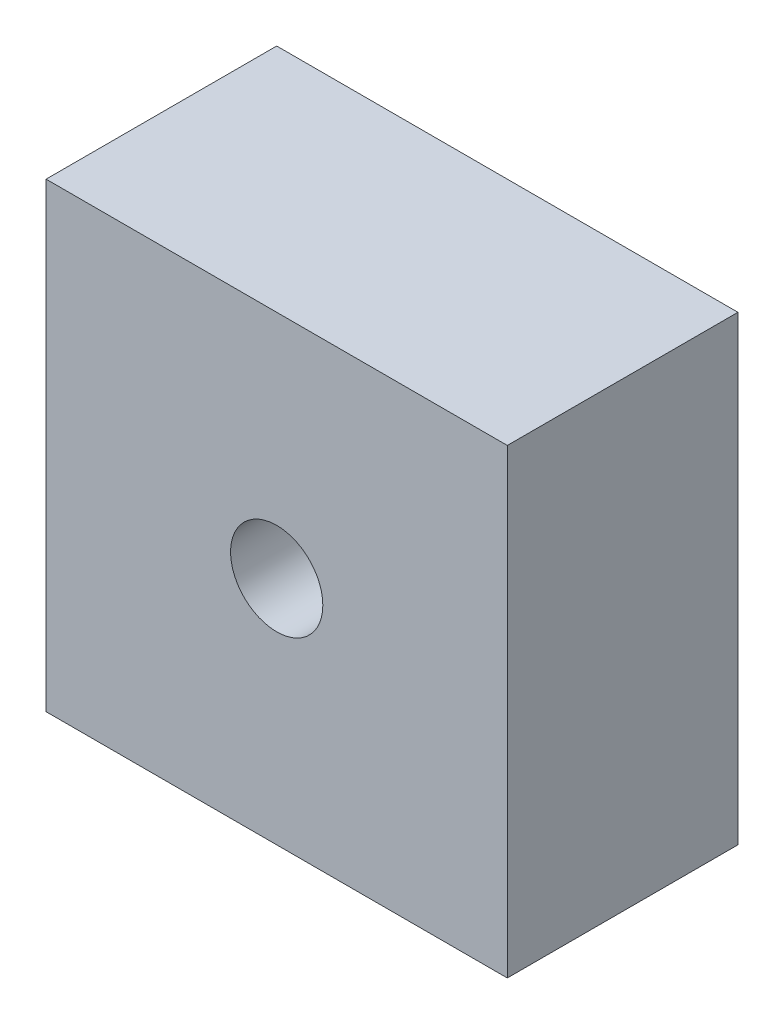
ISO-10303-21;
HEADER;
FILE_DESCRIPTION(('STEP AP214'),'2;1');
FILE_NAME('part.step','',(''),(''),'','','');
FILE_SCHEMA(('AUTOMOTIVE_DESIGN { 1 0 10303 214 1 1 1 1 }'));
ENDSEC;
DATA;
#1=APPLICATION_CONTEXT('core data for automotive mechanical design processes');
#2=APPLICATION_PROTOCOL_DEFINITION('international standard','automotive_design',2000,#1);
#3=PRODUCT_CONTEXT('',#1,'mechanical');
#4=PRODUCT('Part','Part','',(#3));
#5=PRODUCT_RELATED_PRODUCT_CATEGORY('part','',(#4));
#6=PRODUCT_DEFINITION_FORMATION('','',#4);
#7=PRODUCT_DEFINITION_CONTEXT('part definition',#1,'design');
#8=PRODUCT_DEFINITION('design','',#6,#7);
#9=PRODUCT_DEFINITION_SHAPE('','',#8);
#10=(LENGTH_UNIT() NAMED_UNIT(*) SI_UNIT(.MILLI.,.METRE.));
#11=(NAMED_UNIT(*) PLANE_ANGLE_UNIT() SI_UNIT($,.RADIAN.));
#12=(NAMED_UNIT(*) SI_UNIT($,.STERADIAN.) SOLID_ANGLE_UNIT());
#13=UNCERTAINTY_MEASURE_WITH_UNIT(LENGTH_MEASURE(1.E-05),#10,'distance_accuracy_value','');
#14=(GEOMETRIC_REPRESENTATION_CONTEXT(3) GLOBAL_UNCERTAINTY_ASSIGNED_CONTEXT((#13)) GLOBAL_UNIT_ASSIGNED_CONTEXT((#10,
#11,#12)) REPRESENTATION_CONTEXT('',''));
#15=CARTESIAN_POINT('',(0.,0.,0.));
#16=DIRECTION('',(0.,0.,1.));
#17=DIRECTION('',(1.,0.,0.));
#18=AXIS2_PLACEMENT_3D('',#15,#16,#17);
#19=CARTESIAN_POINT('',(-63.5,-63.5,-63.5));
#20=DIRECTION('',(-1.,0.,0.));
#21=DIRECTION('',(0.,0.,1.));
#22=AXIS2_PLACEMENT_3D('',#19,#20,#21);
#23=PLANE('',#22);
#24=DIRECTION('',(0.,-1.,0.));
#25=VECTOR('',#24,1.);
#26=CARTESIAN_POINT('',(-63.5,-63.5,0.));
#27=LINE('',#26,#25);
#28=CARTESIAN_POINT('',(-63.5,63.5,0.));
#29=VERTEX_POINT('',#28);
#30=CARTESIAN_POINT('',(-63.5,-63.5,0.));
#31=VERTEX_POINT('',#30);
#32=EDGE_CURVE('E105',#29,#31,#27,.T.);
#33=ORIENTED_EDGE('',*,*,#32,.F.);
#34=DIRECTION('',(0.,0.,1.));
#35=VECTOR('',#34,1.);
#36=CARTESIAN_POINT('',(-63.5,63.5,-63.5));
#37=LINE('',#36,#35);
#38=CARTESIAN_POINT('',(-63.5,63.5,-63.5));
#39=VERTEX_POINT('',#38);
#40=EDGE_CURVE('E11',#39,#29,#37,.T.);
#41=ORIENTED_EDGE('',*,*,#40,.F.);
#42=DIRECTION('',(0.,-1.,0.));
#43=VECTOR('',#42,1.);
#44=CARTESIAN_POINT('',(-63.5,-63.5,-63.5));
#45=LINE('',#44,#43);
#46=CARTESIAN_POINT('',(-63.5,-63.5,-63.5));
#47=VERTEX_POINT('',#46);
#48=EDGE_CURVE('E98',#39,#47,#45,.T.);
#49=ORIENTED_EDGE('',*,*,#48,.T.);
#50=DIRECTION('',(0.,0.,1.));
#51=VECTOR('',#50,1.);
#52=CARTESIAN_POINT('',(-63.5,-63.5,-63.5));
#53=LINE('',#52,#51);
#54=EDGE_CURVE('E42',#47,#31,#53,.T.);
#55=ORIENTED_EDGE('',*,*,#54,.T.);
#56=EDGE_LOOP('',(#33,#41,#49,#55));
#57=FACE_BOUND('',#56,.T.);
#58=ADVANCED_FACE('F39',(#57),#23,.T.);
#59=CARTESIAN_POINT('',(63.5,63.5,-63.5));
#60=DIRECTION('',(0.,1.,0.));
#61=DIRECTION('',(-1.,0.,0.));
#62=AXIS2_PLACEMENT_3D('',#59,#60,#61);
#63=PLANE('',#62);
#64=DIRECTION('',(-1.,0.,0.));
#65=VECTOR('',#64,1.);
#66=CARTESIAN_POINT('',(63.5,63.5,0.));
#67=LINE('',#66,#65);
#68=CARTESIAN_POINT('',(63.5,63.5,0.));
#69=VERTEX_POINT('',#68);
#70=EDGE_CURVE('E100',#69,#29,#67,.T.);
#71=ORIENTED_EDGE('',*,*,#70,.F.);
#72=DIRECTION('',(0.,0.,1.));
#73=VECTOR('',#72,1.);
#74=CARTESIAN_POINT('',(63.5,63.5,-63.5));
#75=LINE('',#74,#73);
#76=CARTESIAN_POINT('',(63.5,63.5,-63.5));
#77=VERTEX_POINT('',#76);
#78=EDGE_CURVE('E48',#77,#69,#75,.T.);
#79=ORIENTED_EDGE('',*,*,#78,.F.);
#80=DIRECTION('',(-1.,0.,0.));
#81=VECTOR('',#80,1.);
#82=CARTESIAN_POINT('',(63.5,63.5,-63.5));
#83=LINE('',#82,#81);
#84=EDGE_CURVE('E95',#77,#39,#83,.T.);
#85=ORIENTED_EDGE('',*,*,#84,.T.);
#86=ORIENTED_EDGE('',*,*,#40,.T.);
#87=EDGE_LOOP('',(#71,#79,#85,#86));
#88=FACE_BOUND('',#87,.T.);
#89=ADVANCED_FACE('F132',(#88),#63,.T.);
#90=CARTESIAN_POINT('',(63.5,-63.5,-63.5));
#91=DIRECTION('',(1.,0.,0.));
#92=DIRECTION('',(0.,0.,-1.));
#93=AXIS2_PLACEMENT_3D('',#90,#91,#92);
#94=PLANE('',#93);
#95=DIRECTION('',(0.,1.,0.));
#96=VECTOR('',#95,1.);
#97=CARTESIAN_POINT('',(63.5,-63.5,0.));
#98=LINE('',#97,#96);
#99=CARTESIAN_POINT('',(63.5,-63.5,0.));
#100=VERTEX_POINT('',#99);
#101=EDGE_CURVE('E90',#100,#69,#98,.T.);
#102=ORIENTED_EDGE('',*,*,#101,.F.);
#103=DIRECTION('',(0.,0.,1.));
#104=VECTOR('',#103,1.);
#105=CARTESIAN_POINT('',(63.5,-63.5,-63.5));
#106=LINE('',#105,#104);
#107=CARTESIAN_POINT('',(63.5,-63.5,-63.5));
#108=VERTEX_POINT('',#107);
#109=EDGE_CURVE('E85',#108,#100,#106,.T.);
#110=ORIENTED_EDGE('',*,*,#109,.F.);
#111=DIRECTION('',(0.,1.,0.));
#112=VECTOR('',#111,1.);
#113=CARTESIAN_POINT('',(63.5,-63.5,-63.5));
#114=LINE('',#113,#112);
#115=EDGE_CURVE('E88',#108,#77,#114,.T.);
#116=ORIENTED_EDGE('',*,*,#115,.T.);
#117=ORIENTED_EDGE('',*,*,#78,.T.);
#118=EDGE_LOOP('',(#102,#110,#116,#117));
#119=FACE_BOUND('',#118,.T.);
#120=ADVANCED_FACE('F87',(#119),#94,.T.);
#121=CARTESIAN_POINT('',(63.5,-63.5,-63.5));
#122=DIRECTION('',(0.,-1.,0.));
#123=DIRECTION('',(1.,0.,0.));
#124=AXIS2_PLACEMENT_3D('',#121,#122,#123);
#125=PLANE('',#124);
#126=DIRECTION('',(1.,0.,0.));
#127=VECTOR('',#126,1.);
#128=CARTESIAN_POINT('',(63.5,-63.5,0.));
#129=LINE('',#128,#127);
#130=EDGE_CURVE('E108',#31,#100,#129,.T.);
#131=ORIENTED_EDGE('',*,*,#130,.F.);
#132=ORIENTED_EDGE('',*,*,#54,.F.);
#133=DIRECTION('',(1.,0.,0.));
#134=VECTOR('',#133,1.);
#135=CARTESIAN_POINT('',(63.5,-63.5,-63.5));
#136=LINE('',#135,#134);
#137=EDGE_CURVE('E94',#47,#108,#136,.T.);
#138=ORIENTED_EDGE('',*,*,#137,.T.);
#139=ORIENTED_EDGE('',*,*,#109,.T.);
#140=EDGE_LOOP('',(#131,#132,#138,#139));
#141=FACE_BOUND('',#140,.T.);
#142=ADVANCED_FACE('F97',(#141),#125,.T.);
#143=CARTESIAN_POINT('',(-63.5,63.5,-63.5));
#144=DIRECTION('',(0.,0.,1.));
#145=DIRECTION('',(1.,0.,0.));
#146=AXIS2_PLACEMENT_3D('',#143,#144,#145);
#147=PLANE('',#146);
#148=CARTESIAN_POINT('',(0.,0.,-63.5));
#149=DIRECTION('',(0.,0.,1.));
#150=DIRECTION('',(1.,0.,0.));
#151=AXIS2_PLACEMENT_3D('',#148,#149,#150);
#152=CIRCLE('',#151,12.7);
#153=CARTESIAN_POINT('',(12.7,0.,-63.5));
#154=VERTEX_POINT('',#153);
#155=EDGE_CURVE('E109',#154,#154,#152,.T.);
#156=ORIENTED_EDGE('',*,*,#155,.T.);
#157=EDGE_LOOP('',(#156));
#158=FACE_BOUND('',#157,.T.);
#159=ORIENTED_EDGE('',*,*,#48,.F.);
#160=ORIENTED_EDGE('',*,*,#84,.F.);
#161=ORIENTED_EDGE('',*,*,#115,.F.);
#162=ORIENTED_EDGE('',*,*,#137,.F.);
#163=EDGE_LOOP('',(#159,#160,#161,#162));
#164=FACE_BOUND('',#163,.T.);
#165=ADVANCED_FACE('F93',(#158,#164),#147,.F.);
#166=CARTESIAN_POINT('',(-63.5,63.5,0.));
#167=DIRECTION('',(0.,0.,1.));
#168=DIRECTION('',(1.,0.,0.));
#169=AXIS2_PLACEMENT_3D('',#166,#167,#168);
#170=PLANE('',#169);
#171=CARTESIAN_POINT('',(0.,0.,0.));
#172=DIRECTION('',(0.,0.,1.));
#173=DIRECTION('',(1.,0.,0.));
#174=AXIS2_PLACEMENT_3D('',#171,#172,#173);
#175=CIRCLE('',#174,12.7);
#176=CARTESIAN_POINT('',(12.7,0.,0.));
#177=VERTEX_POINT('',#176);
#178=EDGE_CURVE('E119',#177,#177,#175,.T.);
#179=ORIENTED_EDGE('',*,*,#178,.F.);
#180=EDGE_LOOP('',(#179));
#181=FACE_BOUND('',#180,.T.);
#182=ORIENTED_EDGE('',*,*,#32,.T.);
#183=ORIENTED_EDGE('',*,*,#130,.T.);
#184=ORIENTED_EDGE('',*,*,#101,.T.);
#185=ORIENTED_EDGE('',*,*,#70,.T.);
#186=EDGE_LOOP('',(#182,#183,#184,#185));
#187=FACE_BOUND('',#186,.T.);
#188=ADVANCED_FACE('F128',(#181,#187),#170,.T.);
#189=CARTESIAN_POINT('',(0.,0.,-63.5));
#190=DIRECTION('',(0.,0.,1.));
#191=DIRECTION('',(1.,0.,0.));
#192=AXIS2_PLACEMENT_3D('',#189,#190,#191);
#193=CYLINDRICAL_SURFACE('',#192,12.7);
#194=ORIENTED_EDGE('',*,*,#155,.F.);
#195=EDGE_LOOP('',(#194));
#196=FACE_BOUND('',#195,.T.);
#197=ORIENTED_EDGE('',*,*,#178,.T.);
#198=EDGE_LOOP('',(#197));
#199=FACE_BOUND('',#198,.T.);
#200=ADVANCED_FACE('F126',(#196,#199),#193,.F.);
#201=CLOSED_SHELL('',(#58,#89,#120,#142,#165,#188,#200));
#202=MANIFOLD_SOLID_BREP('B2',#201);
#203=ADVANCED_BREP_SHAPE_REPRESENTATION('',(#18,#202),#14);
#204=SHAPE_DEFINITION_REPRESENTATION(#9,#203);
ENDSEC;
END-ISO-10303-21;
